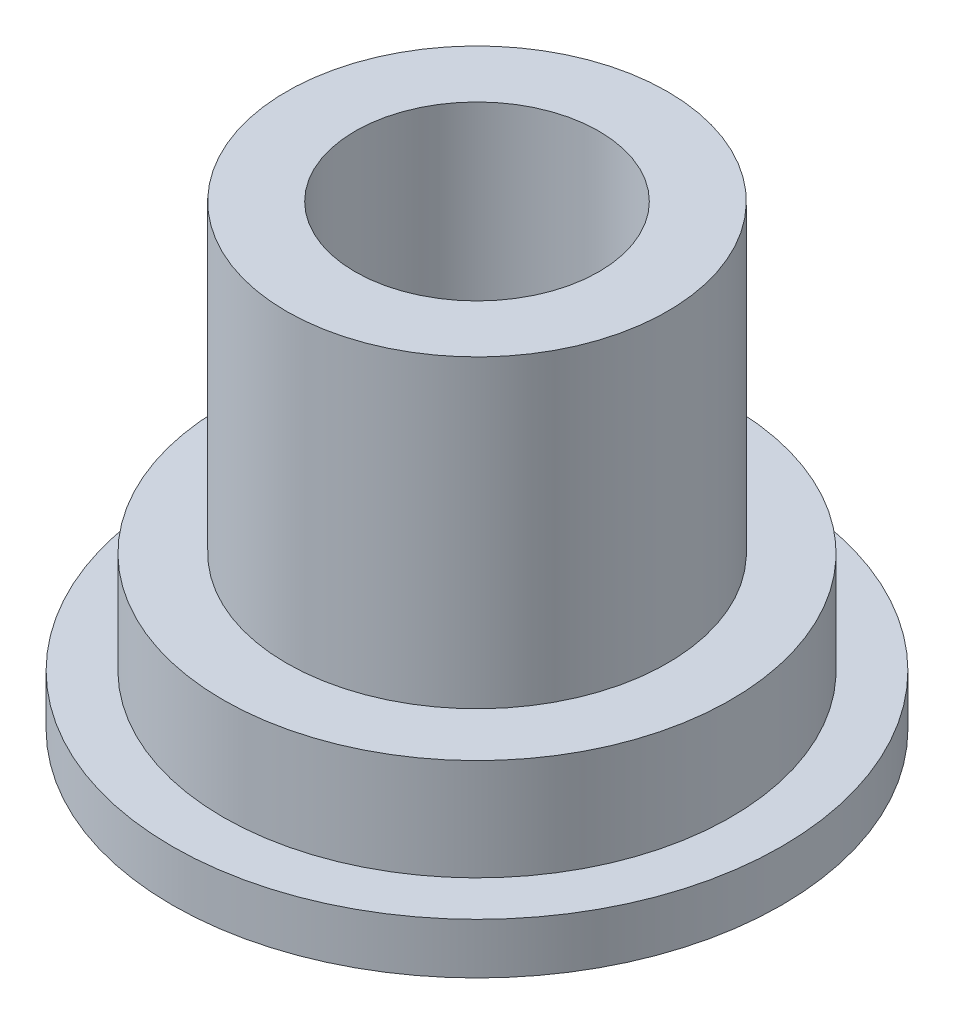
ISO-10303-21;
HEADER;
FILE_DESCRIPTION(('STEP AP214'),'2;1');
FILE_NAME('part.step','',(''),(''),'','','');
FILE_SCHEMA(('AUTOMOTIVE_DESIGN { 1 0 10303 214 1 1 1 1 }'));
ENDSEC;
DATA;
#1=APPLICATION_CONTEXT('core data for automotive mechanical design processes');
#2=APPLICATION_PROTOCOL_DEFINITION('international standard','automotive_design',2000,#1);
#3=PRODUCT_CONTEXT('',#1,'mechanical');
#4=PRODUCT('Part','Part','',(#3));
#5=PRODUCT_RELATED_PRODUCT_CATEGORY('part','',(#4));
#6=PRODUCT_DEFINITION_FORMATION('','',#4);
#7=PRODUCT_DEFINITION_CONTEXT('part definition',#1,'design');
#8=PRODUCT_DEFINITION('design','',#6,#7);
#9=PRODUCT_DEFINITION_SHAPE('','',#8);
#10=(LENGTH_UNIT() NAMED_UNIT(*) SI_UNIT(.MILLI.,.METRE.));
#11=(NAMED_UNIT(*) PLANE_ANGLE_UNIT() SI_UNIT($,.RADIAN.));
#12=(NAMED_UNIT(*) SI_UNIT($,.STERADIAN.) SOLID_ANGLE_UNIT());
#13=UNCERTAINTY_MEASURE_WITH_UNIT(LENGTH_MEASURE(1.E-05),#10,'distance_accuracy_value','');
#14=(GEOMETRIC_REPRESENTATION_CONTEXT(3) GLOBAL_UNCERTAINTY_ASSIGNED_CONTEXT((#13)) GLOBAL_UNIT_ASSIGNED_CONTEXT((#10,
#11,#12)) REPRESENTATION_CONTEXT('',''));
#15=CARTESIAN_POINT('',(0.,0.,0.));
#16=DIRECTION('',(0.,0.,1.));
#17=DIRECTION('',(1.,0.,0.));
#18=AXIS2_PLACEMENT_3D('',#15,#16,#17);
#19=CARTESIAN_POINT('',(0.,2.54,0.));
#20=DIRECTION('',(0.,-1.,0.));
#21=DIRECTION('',(0.,0.,-1.));
#22=AXIS2_PLACEMENT_3D('',#19,#20,#21);
#23=CYLINDRICAL_SURFACE('',#22,6.35);
#24=CARTESIAN_POINT('',(0.,2.54,0.));
#25=DIRECTION('',(0.,1.,0.));
#26=DIRECTION('',(0.,0.,1.));
#27=AXIS2_PLACEMENT_3D('',#24,#25,#26);
#28=CIRCLE('',#27,6.35);
#29=CARTESIAN_POINT('',(0.,2.54,6.35));
#30=VERTEX_POINT('',#29);
#31=EDGE_CURVE('E41',#30,#30,#28,.T.);
#32=ORIENTED_EDGE('',*,*,#31,.F.);
#33=EDGE_LOOP('',(#32));
#34=FACE_BOUND('',#33,.T.);
#35=CARTESIAN_POINT('',(0.,0.,0.));
#36=DIRECTION('',(0.,1.,0.));
#37=DIRECTION('',(0.,0.,1.));
#38=AXIS2_PLACEMENT_3D('',#35,#36,#37);
#39=CIRCLE('',#38,6.35);
#40=CARTESIAN_POINT('',(0.,0.,6.35));
#41=VERTEX_POINT('',#40);
#42=EDGE_CURVE('E37',#41,#41,#39,.T.);
#43=ORIENTED_EDGE('',*,*,#42,.T.);
#44=EDGE_LOOP('',(#43));
#45=FACE_BOUND('',#44,.T.);
#46=ADVANCED_FACE('F34',(#34,#45),#23,.T.);
#47=CARTESIAN_POINT('',(0.,2.54,0.));
#48=DIRECTION('',(0.,1.,0.));
#49=DIRECTION('',(0.,0.,1.));
#50=AXIS2_PLACEMENT_3D('',#47,#48,#49);
#51=PLANE('',#50);
#52=CARTESIAN_POINT('',(0.,2.54,0.));
#53=DIRECTION('',(0.,1.,0.));
#54=DIRECTION('',(0.,0.,1.));
#55=AXIS2_PLACEMENT_3D('',#52,#53,#54);
#56=CIRCLE('',#55,4.7625);
#57=CARTESIAN_POINT('',(0.,2.54,4.7625));
#58=VERTEX_POINT('',#57);
#59=EDGE_CURVE('E10',#58,#58,#56,.T.);
#60=ORIENTED_EDGE('',*,*,#59,.F.);
#61=EDGE_LOOP('',(#60));
#62=FACE_BOUND('',#61,.T.);
#63=ORIENTED_EDGE('',*,*,#31,.T.);
#64=EDGE_LOOP('',(#63));
#65=FACE_BOUND('',#64,.T.);
#66=ADVANCED_FACE('F108',(#62,#65),#51,.T.);
#67=CARTESIAN_POINT('',(0.,10.16,0.));
#68=DIRECTION('',(0.,-1.,0.));
#69=DIRECTION('',(0.,0.,-1.));
#70=AXIS2_PLACEMENT_3D('',#67,#68,#69);
#71=CYLINDRICAL_SURFACE('',#70,4.7625);
#72=CARTESIAN_POINT('',(0.,10.16,0.));
#73=DIRECTION('',(0.,1.,0.));
#74=DIRECTION('',(0.,0.,1.));
#75=AXIS2_PLACEMENT_3D('',#72,#73,#74);
#76=CIRCLE('',#75,4.7625);
#77=CARTESIAN_POINT('',(0.,10.16,4.7625));
#78=VERTEX_POINT('',#77);
#79=EDGE_CURVE('E46',#78,#78,#76,.T.);
#80=ORIENTED_EDGE('',*,*,#79,.F.);
#81=EDGE_LOOP('',(#80));
#82=FACE_BOUND('',#81,.T.);
#83=ORIENTED_EDGE('',*,*,#59,.T.);
#84=EDGE_LOOP('',(#83));
#85=FACE_BOUND('',#84,.T.);
#86=ADVANCED_FACE('F103',(#82,#85),#71,.T.);
#87=CARTESIAN_POINT('',(0.,10.16,0.));
#88=DIRECTION('',(0.,1.,0.));
#89=DIRECTION('',(0.,0.,1.));
#90=AXIS2_PLACEMENT_3D('',#87,#88,#89);
#91=PLANE('',#90);
#92=CARTESIAN_POINT('',(0.,10.16,0.));
#93=DIRECTION('',(0.,1.,0.));
#94=DIRECTION('',(0.,0.,1.));
#95=AXIS2_PLACEMENT_3D('',#92,#93,#94);
#96=CIRCLE('',#95,3.048);
#97=CARTESIAN_POINT('',(0.,10.16,3.048));
#98=VERTEX_POINT('',#97);
#99=EDGE_CURVE('E51',#98,#98,#96,.T.);
#100=ORIENTED_EDGE('',*,*,#99,.F.);
#101=EDGE_LOOP('',(#100));
#102=FACE_BOUND('',#101,.T.);
#103=ORIENTED_EDGE('',*,*,#79,.T.);
#104=EDGE_LOOP('',(#103));
#105=FACE_BOUND('',#104,.T.);
#106=ADVANCED_FACE('F97',(#102,#105),#91,.T.);
#107=CARTESIAN_POINT('',(0.,2.54,0.));
#108=DIRECTION('',(0.,1.,0.));
#109=DIRECTION('',(0.,0.,1.));
#110=AXIS2_PLACEMENT_3D('',#107,#108,#109);
#111=CYLINDRICAL_SURFACE('',#110,3.048);
#112=CARTESIAN_POINT('',(0.,2.54,0.));
#113=DIRECTION('',(0.,1.,0.));
#114=DIRECTION('',(0.,0.,1.));
#115=AXIS2_PLACEMENT_3D('',#112,#113,#114);
#116=CIRCLE('',#115,3.048);
#117=CARTESIAN_POINT('',(0.,2.54,3.048));
#118=VERTEX_POINT('',#117);
#119=EDGE_CURVE('E50',#118,#118,#116,.T.);
#120=ORIENTED_EDGE('',*,*,#119,.F.);
#121=EDGE_LOOP('',(#120));
#122=FACE_BOUND('',#121,.T.);
#123=ORIENTED_EDGE('',*,*,#99,.T.);
#124=EDGE_LOOP('',(#123));
#125=FACE_BOUND('',#124,.T.);
#126=ADVANCED_FACE('F89',(#122,#125),#111,.F.);
#127=CARTESIAN_POINT('',(0.,2.54,0.));
#128=DIRECTION('',(0.,1.,0.));
#129=DIRECTION('',(0.,0.,1.));
#130=AXIS2_PLACEMENT_3D('',#127,#128,#129);
#131=PLANE('',#130);
#132=CARTESIAN_POINT('',(0.,2.54,-1.27));
#133=DIRECTION('',(0.,1.,0.));
#134=DIRECTION('',(0.,0.,1.));
#135=AXIS2_PLACEMENT_3D('',#132,#133,#134);
#136=CIRCLE('',#135,0.762);
#137=CARTESIAN_POINT('',(0.,2.54,-0.508));
#138=VERTEX_POINT('',#137);
#139=EDGE_CURVE('E69',#138,#138,#136,.T.);
#140=ORIENTED_EDGE('',*,*,#139,.F.);
#141=EDGE_LOOP('',(#140));
#142=FACE_BOUND('',#141,.T.);
#143=CARTESIAN_POINT('',(0.,2.54,1.27));
#144=DIRECTION('',(0.,1.,0.));
#145=DIRECTION('',(0.,0.,1.));
#146=AXIS2_PLACEMENT_3D('',#143,#144,#145);
#147=CIRCLE('',#146,0.762);
#148=CARTESIAN_POINT('',(0.,2.54,2.032));
#149=VERTEX_POINT('',#148);
#150=EDGE_CURVE('E60',#149,#149,#147,.T.);
#151=ORIENTED_EDGE('',*,*,#150,.F.);
#152=EDGE_LOOP('',(#151));
#153=FACE_BOUND('',#152,.T.);
#154=ORIENTED_EDGE('',*,*,#119,.T.);
#155=EDGE_LOOP('',(#154));
#156=FACE_BOUND('',#155,.T.);
#157=ADVANCED_FACE('F85',(#142,#153,#156),#131,.T.);
#158=CARTESIAN_POINT('',(0.,-1.27,0.));
#159=DIRECTION('',(0.,1.,0.));
#160=DIRECTION('',(0.,0.,1.));
#161=AXIS2_PLACEMENT_3D('',#158,#159,#160);
#162=CYLINDRICAL_SURFACE('',#161,7.62);
#163=CARTESIAN_POINT('',(0.,-1.27,0.));
#164=DIRECTION('',(0.,-1.,0.));
#165=DIRECTION('',(0.,0.,-1.));
#166=AXIS2_PLACEMENT_3D('',#163,#164,#165);
#167=CIRCLE('',#166,7.62);
#168=CARTESIAN_POINT('',(0.,-1.27,-7.62));
#169=VERTEX_POINT('',#168);
#170=EDGE_CURVE('E59',#169,#169,#167,.T.);
#171=ORIENTED_EDGE('',*,*,#170,.F.);
#172=EDGE_LOOP('',(#171));
#173=FACE_BOUND('',#172,.T.);
#174=CARTESIAN_POINT('',(0.,0.,0.));
#175=DIRECTION('',(0.,-1.,0.));
#176=DIRECTION('',(0.,0.,-1.));
#177=AXIS2_PLACEMENT_3D('',#174,#175,#176);
#178=CIRCLE('',#177,7.62);
#179=CARTESIAN_POINT('',(0.,0.,-7.62));
#180=VERTEX_POINT('',#179);
#181=EDGE_CURVE('E56',#180,#180,#178,.T.);
#182=ORIENTED_EDGE('',*,*,#181,.T.);
#183=EDGE_LOOP('',(#182));
#184=FACE_BOUND('',#183,.T.);
#185=ADVANCED_FACE('F88',(#173,#184),#162,.T.);
#186=CARTESIAN_POINT('',(0.,-1.27,0.));
#187=DIRECTION('',(0.,-1.,0.));
#188=DIRECTION('',(0.,0.,-1.));
#189=AXIS2_PLACEMENT_3D('',#186,#187,#188);
#190=PLANE('',#189);
#191=CARTESIAN_POINT('',(0.,-1.27,-1.27));
#192=DIRECTION('',(0.,1.,0.));
#193=DIRECTION('',(0.,0.,1.));
#194=AXIS2_PLACEMENT_3D('',#191,#192,#193);
#195=CIRCLE('',#194,0.762);
#196=CARTESIAN_POINT('',(0.,-1.27,-0.508));
#197=VERTEX_POINT('',#196);
#198=EDGE_CURVE('E68',#197,#197,#195,.T.);
#199=ORIENTED_EDGE('',*,*,#198,.T.);
#200=EDGE_LOOP('',(#199));
#201=FACE_BOUND('',#200,.T.);
#202=CARTESIAN_POINT('',(0.,-1.27,1.27));
#203=DIRECTION('',(0.,1.,0.));
#204=DIRECTION('',(0.,0.,1.));
#205=AXIS2_PLACEMENT_3D('',#202,#203,#204);
#206=CIRCLE('',#205,0.762);
#207=CARTESIAN_POINT('',(0.,-1.27,2.032));
#208=VERTEX_POINT('',#207);
#209=EDGE_CURVE('E65',#208,#208,#206,.T.);
#210=ORIENTED_EDGE('',*,*,#209,.T.);
#211=EDGE_LOOP('',(#210));
#212=FACE_BOUND('',#211,.T.);
#213=ORIENTED_EDGE('',*,*,#170,.T.);
#214=EDGE_LOOP('',(#213));
#215=FACE_BOUND('',#214,.T.);
#216=ADVANCED_FACE('F75',(#201,#212,#215),#190,.T.);
#217=CARTESIAN_POINT('',(0.,0.,0.));
#218=DIRECTION('',(0.,-1.,0.));
#219=DIRECTION('',(0.,0.,-1.));
#220=AXIS2_PLACEMENT_3D('',#217,#218,#219);
#221=PLANE('',#220);
#222=ORIENTED_EDGE('',*,*,#42,.F.);
#223=EDGE_LOOP('',(#222));
#224=FACE_BOUND('',#223,.T.);
#225=ORIENTED_EDGE('',*,*,#181,.F.);
#226=EDGE_LOOP('',(#225));
#227=FACE_BOUND('',#226,.T.);
#228=ADVANCED_FACE('F123',(#224,#227),#221,.F.);
#229=CARTESIAN_POINT('',(0.,-1.27,1.27));
#230=DIRECTION('',(0.,1.,0.));
#231=DIRECTION('',(0.,0.,1.));
#232=AXIS2_PLACEMENT_3D('',#229,#230,#231);
#233=CYLINDRICAL_SURFACE('',#232,0.762);
#234=ORIENTED_EDGE('',*,*,#150,.T.);
#235=EDGE_LOOP('',(#234));
#236=FACE_BOUND('',#235,.T.);
#237=ORIENTED_EDGE('',*,*,#209,.F.);
#238=EDGE_LOOP('',(#237));
#239=FACE_BOUND('',#238,.T.);
#240=ADVANCED_FACE('F81',(#236,#239),#233,.F.);
#241=CARTESIAN_POINT('',(0.,-1.27,-1.27));
#242=DIRECTION('',(0.,1.,0.));
#243=DIRECTION('',(0.,0.,1.));
#244=AXIS2_PLACEMENT_3D('',#241,#242,#243);
#245=CYLINDRICAL_SURFACE('',#244,0.762);
#246=ORIENTED_EDGE('',*,*,#198,.F.);
#247=EDGE_LOOP('',(#246));
#248=FACE_BOUND('',#247,.T.);
#249=ORIENTED_EDGE('',*,*,#139,.T.);
#250=EDGE_LOOP('',(#249));
#251=FACE_BOUND('',#250,.T.);
#252=ADVANCED_FACE('F78',(#248,#251),#245,.F.);
#253=CLOSED_SHELL('',(#46,#66,#86,#106,#126,#157,#185,#216,#228,#240,#252));
#254=MANIFOLD_SOLID_BREP('B2',#253);
#255=ADVANCED_BREP_SHAPE_REPRESENTATION('',(#18,#254),#14);
#256=SHAPE_DEFINITION_REPRESENTATION(#9,#255);
ENDSEC;
END-ISO-10303-21;
